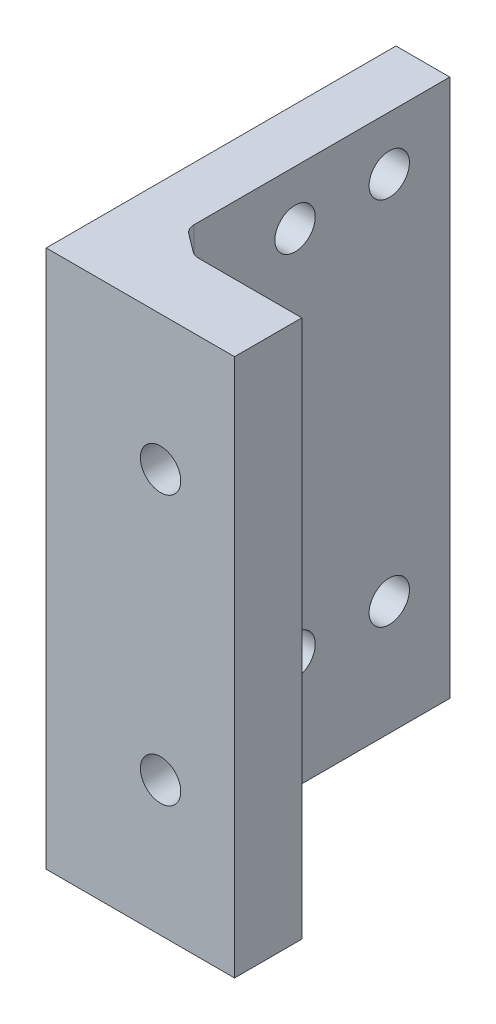
ISO-10303-21;
HEADER;
FILE_DESCRIPTION(('STEP AP214'),'2;1');
FILE_NAME('part.step','',(''),(''),'','','');
FILE_SCHEMA(('AUTOMOTIVE_DESIGN { 1 0 10303 214 1 1 1 1 }'));
ENDSEC;
DATA;
#1=APPLICATION_CONTEXT('core data for automotive mechanical design processes');
#2=APPLICATION_PROTOCOL_DEFINITION('international standard','automotive_design',2000,#1);
#3=PRODUCT_CONTEXT('',#1,'mechanical');
#4=PRODUCT('Part','Part','',(#3));
#5=PRODUCT_RELATED_PRODUCT_CATEGORY('part','',(#4));
#6=PRODUCT_DEFINITION_FORMATION('','',#4);
#7=PRODUCT_DEFINITION_CONTEXT('part definition',#1,'design');
#8=PRODUCT_DEFINITION('design','',#6,#7);
#9=PRODUCT_DEFINITION_SHAPE('','',#8);
#10=(LENGTH_UNIT() NAMED_UNIT(*) SI_UNIT(.MILLI.,.METRE.));
#11=(NAMED_UNIT(*) PLANE_ANGLE_UNIT() SI_UNIT($,.RADIAN.));
#12=(NAMED_UNIT(*) SI_UNIT($,.STERADIAN.) SOLID_ANGLE_UNIT());
#13=UNCERTAINTY_MEASURE_WITH_UNIT(LENGTH_MEASURE(1.E-05),#10,'distance_accuracy_value','');
#14=(GEOMETRIC_REPRESENTATION_CONTEXT(3) GLOBAL_UNCERTAINTY_ASSIGNED_CONTEXT((#13)) GLOBAL_UNIT_ASSIGNED_CONTEXT((#10,
#11,#12)) REPRESENTATION_CONTEXT('',''));
#15=CARTESIAN_POINT('',(0.,0.,0.));
#16=DIRECTION('',(0.,0.,1.));
#17=DIRECTION('',(1.,0.,0.));
#18=AXIS2_PLACEMENT_3D('',#15,#16,#17);
#19=CARTESIAN_POINT('',(15.,-20.,-4.));
#20=DIRECTION('',(1.,0.,0.));
#21=DIRECTION('',(0.,0.,-1.));
#22=AXIS2_PLACEMENT_3D('',#19,#20,#21);
#23=PLANE('',#22);
#24=DIRECTION('',(0.,0.,1.));
#25=VECTOR('',#24,1.);
#26=CARTESIAN_POINT('',(15.,20.,-4.));
#27=LINE('',#26,#25);
#28=CARTESIAN_POINT('',(15.,20.,-4.));
#29=VERTEX_POINT('',#28);
#30=CARTESIAN_POINT('',(15.,20.,15.));
#31=VERTEX_POINT('',#30);
#32=EDGE_CURVE('E220',#29,#31,#27,.T.);
#33=ORIENTED_EDGE('',*,*,#32,.T.);
#34=DIRECTION('',(0.,-1.,0.));
#35=VECTOR('',#34,1.);
#36=CARTESIAN_POINT('',(15.,-20.,15.));
#37=LINE('',#36,#35);
#38=CARTESIAN_POINT('',(15.,-20.,15.));
#39=VERTEX_POINT('',#38);
#40=EDGE_CURVE('E222',#31,#39,#37,.T.);
#41=ORIENTED_EDGE('',*,*,#40,.T.);
#42=DIRECTION('',(0.,0.,1.));
#43=VECTOR('',#42,1.);
#44=CARTESIAN_POINT('',(15.,-20.,-4.));
#45=LINE('',#44,#43);
#46=CARTESIAN_POINT('',(15.,-20.,-4.));
#47=VERTEX_POINT('',#46);
#48=EDGE_CURVE('E121',#47,#39,#45,.T.);
#49=ORIENTED_EDGE('',*,*,#48,.F.);
#50=DIRECTION('',(0.,1.,0.));
#51=VECTOR('',#50,1.);
#52=CARTESIAN_POINT('',(15.,-20.,-4.));
#53=LINE('',#52,#51);
#54=EDGE_CURVE('E204',#47,#29,#53,.T.);
#55=ORIENTED_EDGE('',*,*,#54,.T.);
#56=EDGE_LOOP('',(#33,#41,#49,#55));
#57=FACE_BOUND('',#56,.T.);
#58=CARTESIAN_POINT('',(15.,15.9999999999999,7.5));
#59=DIRECTION('',(1.,0.,0.));
#60=DIRECTION('',(0.,0.,-1.));
#61=AXIS2_PLACEMENT_3D('',#58,#59,#60);
#62=CIRCLE('',#61,1.5);
#63=CARTESIAN_POINT('',(15.,15.9999999999999,6.));
#64=VERTEX_POINT('',#63);
#65=EDGE_CURVE('E189',#64,#64,#62,.T.);
#66=ORIENTED_EDGE('',*,*,#65,.F.);
#67=EDGE_LOOP('',(#66));
#68=FACE_BOUND('',#67,.T.);
#69=CARTESIAN_POINT('',(15.,-11.5,0.500000000000174));
#70=DIRECTION('',(1.,0.,0.));
#71=DIRECTION('',(0.,0.,-1.));
#72=AXIS2_PLACEMENT_3D('',#69,#70,#71);
#73=CIRCLE('',#72,1.5);
#74=CARTESIAN_POINT('',(15.,-11.5,-0.999999999999826));
#75=VERTEX_POINT('',#74);
#76=EDGE_CURVE('E180',#75,#75,#73,.T.);
#77=ORIENTED_EDGE('',*,*,#76,.F.);
#78=EDGE_LOOP('',(#77));
#79=FACE_BOUND('',#78,.T.);
#80=CARTESIAN_POINT('',(15.,-11.5,7.5));
#81=DIRECTION('',(1.,0.,0.));
#82=DIRECTION('',(0.,0.,-1.));
#83=AXIS2_PLACEMENT_3D('',#80,#81,#82);
#84=CIRCLE('',#83,1.5);
#85=CARTESIAN_POINT('',(15.,-11.5,6.));
#86=VERTEX_POINT('',#85);
#87=EDGE_CURVE('E175',#86,#86,#84,.T.);
#88=ORIENTED_EDGE('',*,*,#87,.F.);
#89=EDGE_LOOP('',(#88));
#90=FACE_BOUND('',#89,.T.);
#91=CARTESIAN_POINT('',(15.,16.0000000000001,0.500000000000175));
#92=DIRECTION('',(1.,0.,0.));
#93=DIRECTION('',(0.,0.,-1.));
#94=AXIS2_PLACEMENT_3D('',#91,#92,#93);
#95=CIRCLE('',#94,1.5);
#96=CARTESIAN_POINT('',(15.,16.0000000000001,-0.999999999999826));
#97=VERTEX_POINT('',#96);
#98=EDGE_CURVE('E188',#97,#97,#95,.T.);
#99=ORIENTED_EDGE('',*,*,#98,.F.);
#100=EDGE_LOOP('',(#99));
#101=FACE_BOUND('',#100,.T.);
#102=ADVANCED_FACE('F39',(#57,#68,#79,#90,#101),#23,.T.);
#103=CARTESIAN_POINT('',(15.,-20.,-4.));
#104=DIRECTION('',(0.,-1.,0.));
#105=DIRECTION('',(1.,0.,0.));
#106=AXIS2_PLACEMENT_3D('',#103,#104,#105);
#107=PLANE('',#106);
#108=ORIENTED_EDGE('',*,*,#48,.T.);
#109=CARTESIAN_POINT('',(16.,-20.,15.));
#110=DIRECTION('',(0.,-1.,0.));
#111=DIRECTION('',(1.,0.,0.));
#112=AXIS2_PLACEMENT_3D('',#109,#110,#111);
#113=CIRCLE('',#112,1.);
#114=CARTESIAN_POINT('',(15.4,-20.,15.8));
#115=VERTEX_POINT('',#114);
#116=EDGE_CURVE('E241',#39,#115,#113,.F.);
#117=ORIENTED_EDGE('',*,*,#116,.T.);
#118=DIRECTION('',(0.799999999999999,0.,0.600000000000001));
#119=VECTOR('',#118,1.);
#120=CARTESIAN_POINT('',(15.,-20.,15.5));
#121=LINE('',#120,#119);
#122=CARTESIAN_POINT('',(16.7333333333334,-20.,16.8));
#123=VERTEX_POINT('',#122);
#124=EDGE_CURVE('E262',#115,#123,#121,.T.);
#125=ORIENTED_EDGE('',*,*,#124,.T.);
#126=CARTESIAN_POINT('',(17.3333333333334,-20.,16.));
#127=DIRECTION('',(0.,-1.,0.));
#128=DIRECTION('',(1.,0.,0.));
#129=AXIS2_PLACEMENT_3D('',#126,#127,#128);
#130=CIRCLE('',#129,1.);
#131=CARTESIAN_POINT('',(17.3333333333334,-20.,17.));
#132=VERTEX_POINT('',#131);
#133=EDGE_CURVE('E48',#123,#132,#130,.F.);
#134=ORIENTED_EDGE('',*,*,#133,.T.);
#135=DIRECTION('',(-1.,0.,0.));
#136=VECTOR('',#135,1.);
#137=CARTESIAN_POINT('',(25.,-20.,17.));
#138=LINE('',#137,#136);
#139=CARTESIAN_POINT('',(25.,-20.,17.));
#140=VERTEX_POINT('',#139);
#141=EDGE_CURVE('E172',#140,#132,#138,.T.);
#142=ORIENTED_EDGE('',*,*,#141,.F.);
#143=DIRECTION('',(0.,0.,-1.));
#144=VECTOR('',#143,1.);
#145=CARTESIAN_POINT('',(25.,-20.,20.));
#146=LINE('',#145,#144);
#147=CARTESIAN_POINT('',(25.,-20.,22.));
#148=VERTEX_POINT('',#147);
#149=EDGE_CURVE('E128',#148,#140,#146,.T.);
#150=ORIENTED_EDGE('',*,*,#149,.F.);
#151=DIRECTION('',(1.,0.,0.));
#152=VECTOR('',#151,1.);
#153=CARTESIAN_POINT('',(11.,-20.,22.));
#154=LINE('',#153,#152);
#155=CARTESIAN_POINT('',(11.,-20.,22.));
#156=VERTEX_POINT('',#155);
#157=EDGE_CURVE('E125',#156,#148,#154,.T.);
#158=ORIENTED_EDGE('',*,*,#157,.F.);
#159=DIRECTION('',(0.,0.,1.));
#160=VECTOR('',#159,1.);
#161=CARTESIAN_POINT('',(11.,-20.,-4.));
#162=LINE('',#161,#160);
#163=CARTESIAN_POINT('',(11.,-20.,-4.));
#164=VERTEX_POINT('',#163);
#165=EDGE_CURVE('E111',#164,#156,#162,.T.);
#166=ORIENTED_EDGE('',*,*,#165,.F.);
#167=DIRECTION('',(1.,0.,0.));
#168=VECTOR('',#167,1.);
#169=CARTESIAN_POINT('',(15.,-20.,-4.));
#170=LINE('',#169,#168);
#171=EDGE_CURVE('E217',#164,#47,#170,.T.);
#172=ORIENTED_EDGE('',*,*,#171,.T.);
#173=EDGE_LOOP('',(#108,#117,#125,#134,#142,#150,#158,#166,#172));
#174=FACE_BOUND('',#173,.T.);
#175=ADVANCED_FACE('F127',(#174),#107,.T.);
#176=CARTESIAN_POINT('',(11.,-20.,-4.));
#177=DIRECTION('',(-1.,0.,0.));
#178=DIRECTION('',(0.,-1.,0.));
#179=AXIS2_PLACEMENT_3D('',#176,#177,#178);
#180=PLANE('',#179);
#181=CARTESIAN_POINT('',(11.,15.9999999999999,7.5));
#182=DIRECTION('',(1.,0.,0.));
#183=DIRECTION('',(0.,0.,-1.));
#184=AXIS2_PLACEMENT_3D('',#181,#182,#183);
#185=CIRCLE('',#184,1.5);
#186=CARTESIAN_POINT('',(11.,15.9999999999999,6.));
#187=VERTEX_POINT('',#186);
#188=EDGE_CURVE('E184',#187,#187,#185,.T.);
#189=ORIENTED_EDGE('',*,*,#188,.T.);
#190=EDGE_LOOP('',(#189));
#191=FACE_BOUND('',#190,.T.);
#192=CARTESIAN_POINT('',(11.,-11.5,0.500000000000174));
#193=DIRECTION('',(1.,0.,0.));
#194=DIRECTION('',(0.,0.,-1.));
#195=AXIS2_PLACEMENT_3D('',#192,#193,#194);
#196=CIRCLE('',#195,1.5);
#197=CARTESIAN_POINT('',(11.,-11.5,-0.999999999999826));
#198=VERTEX_POINT('',#197);
#199=EDGE_CURVE('E193',#198,#198,#196,.T.);
#200=ORIENTED_EDGE('',*,*,#199,.T.);
#201=EDGE_LOOP('',(#200));
#202=FACE_BOUND('',#201,.T.);
#203=CARTESIAN_POINT('',(11.,-11.5,7.5));
#204=DIRECTION('',(1.,0.,0.));
#205=DIRECTION('',(0.,0.,-1.));
#206=AXIS2_PLACEMENT_3D('',#203,#204,#205);
#207=CIRCLE('',#206,1.5);
#208=CARTESIAN_POINT('',(11.,-11.5,6.));
#209=VERTEX_POINT('',#208);
#210=EDGE_CURVE('E176',#209,#209,#207,.T.);
#211=ORIENTED_EDGE('',*,*,#210,.T.);
#212=EDGE_LOOP('',(#211));
#213=FACE_BOUND('',#212,.T.);
#214=CARTESIAN_POINT('',(11.,16.0000000000001,0.500000000000175));
#215=DIRECTION('',(1.,0.,0.));
#216=DIRECTION('',(0.,0.,-1.));
#217=AXIS2_PLACEMENT_3D('',#214,#215,#216);
#218=CIRCLE('',#217,1.5);
#219=CARTESIAN_POINT('',(11.,16.0000000000001,-0.999999999999826));
#220=VERTEX_POINT('',#219);
#221=EDGE_CURVE('E200',#220,#220,#218,.T.);
#222=ORIENTED_EDGE('',*,*,#221,.T.);
#223=EDGE_LOOP('',(#222));
#224=FACE_BOUND('',#223,.T.);
#225=ORIENTED_EDGE('',*,*,#165,.T.);
#226=DIRECTION('',(0.,-1.,0.));
#227=VECTOR('',#226,1.);
#228=CARTESIAN_POINT('',(11.,20.,22.));
#229=LINE('',#228,#227);
#230=CARTESIAN_POINT('',(11.,20.,22.));
#231=VERTEX_POINT('',#230);
#232=EDGE_CURVE('E115',#231,#156,#229,.T.);
#233=ORIENTED_EDGE('',*,*,#232,.F.);
#234=DIRECTION('',(0.,0.,1.));
#235=VECTOR('',#234,1.);
#236=CARTESIAN_POINT('',(11.,20.,-4.));
#237=LINE('',#236,#235);
#238=CARTESIAN_POINT('',(11.,20.,-4.));
#239=VERTEX_POINT('',#238);
#240=EDGE_CURVE('E122',#239,#231,#237,.T.);
#241=ORIENTED_EDGE('',*,*,#240,.F.);
#242=DIRECTION('',(0.,-1.,0.));
#243=VECTOR('',#242,1.);
#244=CARTESIAN_POINT('',(11.,-20.,-4.));
#245=LINE('',#244,#243);
#246=EDGE_CURVE('E117',#239,#164,#245,.T.);
#247=ORIENTED_EDGE('',*,*,#246,.T.);
#248=EDGE_LOOP('',(#225,#233,#241,#247));
#249=FACE_BOUND('',#248,.T.);
#250=ADVANCED_FACE('F113',(#191,#202,#213,#224,#249),#180,.T.);
#251=CARTESIAN_POINT('',(15.,20.,-4.));
#252=DIRECTION('',(0.,1.,0.));
#253=DIRECTION('',(0.,0.,1.));
#254=AXIS2_PLACEMENT_3D('',#251,#252,#253);
#255=PLANE('',#254);
#256=DIRECTION('',(0.799999999999999,0.,0.600000000000001));
#257=VECTOR('',#256,1.);
#258=CARTESIAN_POINT('',(15.,20.,15.5));
#259=LINE('',#258,#257);
#260=CARTESIAN_POINT('',(15.4,20.,15.8));
#261=VERTEX_POINT('',#260);
#262=CARTESIAN_POINT('',(16.7333333333333,20.,16.8));
#263=VERTEX_POINT('',#262);
#264=EDGE_CURVE('E253',#261,#263,#259,.T.);
#265=ORIENTED_EDGE('',*,*,#264,.F.);
#266=CARTESIAN_POINT('',(16.,20.,15.));
#267=DIRECTION('',(0.,1.,0.));
#268=DIRECTION('',(0.,0.,1.));
#269=AXIS2_PLACEMENT_3D('',#266,#267,#268);
#270=CIRCLE('',#269,1.);
#271=EDGE_CURVE('E244',#261,#31,#270,.F.);
#272=ORIENTED_EDGE('',*,*,#271,.T.);
#273=ORIENTED_EDGE('',*,*,#32,.F.);
#274=DIRECTION('',(-1.,0.,0.));
#275=VECTOR('',#274,1.);
#276=CARTESIAN_POINT('',(15.,20.,-4.));
#277=LINE('',#276,#275);
#278=EDGE_CURVE('E211',#29,#239,#277,.T.);
#279=ORIENTED_EDGE('',*,*,#278,.T.);
#280=ORIENTED_EDGE('',*,*,#240,.T.);
#281=DIRECTION('',(-1.,0.,0.));
#282=VECTOR('',#281,1.);
#283=CARTESIAN_POINT('',(11.,20.,22.));
#284=LINE('',#283,#282);
#285=CARTESIAN_POINT('',(25.,20.,22.));
#286=VERTEX_POINT('',#285);
#287=EDGE_CURVE('E139',#286,#231,#284,.T.);
#288=ORIENTED_EDGE('',*,*,#287,.F.);
#289=DIRECTION('',(0.,0.,1.));
#290=VECTOR('',#289,1.);
#291=CARTESIAN_POINT('',(25.,20.,20.));
#292=LINE('',#291,#290);
#293=CARTESIAN_POINT('',(25.,20.,17.));
#294=VERTEX_POINT('',#293);
#295=EDGE_CURVE('E166',#294,#286,#292,.T.);
#296=ORIENTED_EDGE('',*,*,#295,.F.);
#297=DIRECTION('',(-1.,0.,0.));
#298=VECTOR('',#297,1.);
#299=CARTESIAN_POINT('',(25.,20.,17.));
#300=LINE('',#299,#298);
#301=CARTESIAN_POINT('',(17.3333333333333,20.,17.));
#302=VERTEX_POINT('',#301);
#303=EDGE_CURVE('E169',#294,#302,#300,.T.);
#304=ORIENTED_EDGE('',*,*,#303,.T.);
#305=CARTESIAN_POINT('',(17.3333333333333,20.,16.));
#306=DIRECTION('',(0.,1.,0.));
#307=DIRECTION('',(0.,0.,1.));
#308=AXIS2_PLACEMENT_3D('',#305,#306,#307);
#309=CIRCLE('',#308,1.);
#310=EDGE_CURVE('E11',#302,#263,#309,.F.);
#311=ORIENTED_EDGE('',*,*,#310,.T.);
#312=EDGE_LOOP('',(#265,#272,#273,#279,#280,#288,#296,#304,#311));
#313=FACE_BOUND('',#312,.T.);
#314=ADVANCED_FACE('F250',(#313),#255,.T.);
#315=CARTESIAN_POINT('',(0.,0.,-4.));
#316=DIRECTION('',(0.,0.,1.));
#317=DIRECTION('',(1.,0.,0.));
#318=AXIS2_PLACEMENT_3D('',#315,#316,#317);
#319=PLANE('',#318);
#320=ORIENTED_EDGE('',*,*,#54,.F.);
#321=ORIENTED_EDGE('',*,*,#171,.F.);
#322=ORIENTED_EDGE('',*,*,#246,.F.);
#323=ORIENTED_EDGE('',*,*,#278,.F.);
#324=EDGE_LOOP('',(#320,#321,#322,#323));
#325=FACE_BOUND('',#324,.T.);
#326=ADVANCED_FACE('F309',(#325),#319,.F.);
#327=CARTESIAN_POINT('',(11.,16.0000000000001,0.500000000000175));
#328=DIRECTION('',(1.,0.,0.));
#329=DIRECTION('',(0.,0.,-1.));
#330=AXIS2_PLACEMENT_3D('',#327,#328,#329);
#331=CYLINDRICAL_SURFACE('',#330,1.5);
#332=ORIENTED_EDGE('',*,*,#221,.F.);
#333=EDGE_LOOP('',(#332));
#334=FACE_BOUND('',#333,.T.);
#335=ORIENTED_EDGE('',*,*,#98,.T.);
#336=EDGE_LOOP('',(#335));
#337=FACE_BOUND('',#336,.T.);
#338=ADVANCED_FACE('F311',(#334,#337),#331,.F.);
#339=CARTESIAN_POINT('',(11.,-11.5,7.5));
#340=DIRECTION('',(1.,0.,0.));
#341=DIRECTION('',(0.,0.,-1.));
#342=AXIS2_PLACEMENT_3D('',#339,#340,#341);
#343=CYLINDRICAL_SURFACE('',#342,1.5);
#344=ORIENTED_EDGE('',*,*,#210,.F.);
#345=EDGE_LOOP('',(#344));
#346=FACE_BOUND('',#345,.T.);
#347=ORIENTED_EDGE('',*,*,#87,.T.);
#348=EDGE_LOOP('',(#347));
#349=FACE_BOUND('',#348,.T.);
#350=ADVANCED_FACE('F317',(#346,#349),#343,.F.);
#351=CARTESIAN_POINT('',(11.,-11.5,0.500000000000174));
#352=DIRECTION('',(1.,0.,0.));
#353=DIRECTION('',(0.,0.,-1.));
#354=AXIS2_PLACEMENT_3D('',#351,#352,#353);
#355=CYLINDRICAL_SURFACE('',#354,1.5);
#356=ORIENTED_EDGE('',*,*,#199,.F.);
#357=EDGE_LOOP('',(#356));
#358=FACE_BOUND('',#357,.T.);
#359=ORIENTED_EDGE('',*,*,#76,.T.);
#360=EDGE_LOOP('',(#359));
#361=FACE_BOUND('',#360,.T.);
#362=ADVANCED_FACE('F338',(#358,#361),#355,.F.);
#363=CARTESIAN_POINT('',(11.,15.9999999999999,7.5));
#364=DIRECTION('',(1.,0.,0.));
#365=DIRECTION('',(0.,0.,-1.));
#366=AXIS2_PLACEMENT_3D('',#363,#364,#365);
#367=CYLINDRICAL_SURFACE('',#366,1.5);
#368=ORIENTED_EDGE('',*,*,#188,.F.);
#369=EDGE_LOOP('',(#368));
#370=FACE_BOUND('',#369,.T.);
#371=ORIENTED_EDGE('',*,*,#65,.T.);
#372=EDGE_LOOP('',(#371));
#373=FACE_BOUND('',#372,.T.);
#374=ADVANCED_FACE('F345',(#370,#373),#367,.F.);
#375=CARTESIAN_POINT('',(25.,20.,17.));
#376=DIRECTION('',(0.,0.,1.));
#377=DIRECTION('',(0.,-1.,0.));
#378=AXIS2_PLACEMENT_3D('',#375,#376,#377);
#379=PLANE('',#378);
#380=CARTESIAN_POINT('',(19.5,-9.99999999999999,17.));
#381=DIRECTION('',(0.,0.,-1.));
#382=DIRECTION('',(0.,1.,0.));
#383=AXIS2_PLACEMENT_3D('',#380,#381,#382);
#384=CIRCLE('',#383,1.5);
#385=CARTESIAN_POINT('',(19.5,-8.49999999999999,17.));
#386=VERTEX_POINT('',#385);
#387=EDGE_CURVE('E154',#386,#386,#384,.T.);
#388=ORIENTED_EDGE('',*,*,#387,.F.);
#389=EDGE_LOOP('',(#388));
#390=FACE_BOUND('',#389,.T.);
#391=CARTESIAN_POINT('',(19.5,10.,17.));
#392=DIRECTION('',(0.,0.,-1.));
#393=DIRECTION('',(0.,1.,0.));
#394=AXIS2_PLACEMENT_3D('',#391,#392,#393);
#395=CIRCLE('',#394,1.5);
#396=CARTESIAN_POINT('',(19.5,11.5,17.));
#397=VERTEX_POINT('',#396);
#398=EDGE_CURVE('E153',#397,#397,#395,.T.);
#399=ORIENTED_EDGE('',*,*,#398,.F.);
#400=EDGE_LOOP('',(#399));
#401=FACE_BOUND('',#400,.T.);
#402=ORIENTED_EDGE('',*,*,#141,.T.);
#403=DIRECTION('',(0.,-1.,0.));
#404=VECTOR('',#403,1.);
#405=CARTESIAN_POINT('',(17.3333333333333,20.,17.));
#406=LINE('',#405,#404);
#407=EDGE_CURVE('E55',#132,#302,#406,.F.);
#408=ORIENTED_EDGE('',*,*,#407,.T.);
#409=ORIENTED_EDGE('',*,*,#303,.F.);
#410=DIRECTION('',(0.,1.,0.));
#411=VECTOR('',#410,1.);
#412=CARTESIAN_POINT('',(25.,20.,17.));
#413=LINE('',#412,#411);
#414=EDGE_CURVE('E163',#140,#294,#413,.T.);
#415=ORIENTED_EDGE('',*,*,#414,.F.);
#416=EDGE_LOOP('',(#402,#408,#409,#415));
#417=FACE_BOUND('',#416,.T.);
#418=ADVANCED_FACE('F305',(#390,#401,#417),#379,.F.);
#419=CARTESIAN_POINT('',(25.,0.,0.));
#420=DIRECTION('',(1.,0.,0.));
#421=DIRECTION('',(0.,0.,-1.));
#422=AXIS2_PLACEMENT_3D('',#419,#420,#421);
#423=PLANE('',#422);
#424=ORIENTED_EDGE('',*,*,#295,.T.);
#425=DIRECTION('',(0.,1.,0.));
#426=VECTOR('',#425,1.);
#427=CARTESIAN_POINT('',(25.,20.,22.));
#428=LINE('',#427,#426);
#429=EDGE_CURVE('E133',#148,#286,#428,.T.);
#430=ORIENTED_EDGE('',*,*,#429,.F.);
#431=ORIENTED_EDGE('',*,*,#149,.T.);
#432=ORIENTED_EDGE('',*,*,#414,.T.);
#433=EDGE_LOOP('',(#424,#430,#431,#432));
#434=FACE_BOUND('',#433,.T.);
#435=ADVANCED_FACE('F307',(#434),#423,.T.);
#436=CARTESIAN_POINT('',(19.5,10.,20.));
#437=DIRECTION('',(0.,0.,-1.));
#438=DIRECTION('',(0.,1.,0.));
#439=AXIS2_PLACEMENT_3D('',#436,#437,#438);
#440=CYLINDRICAL_SURFACE('',#439,1.5);
#441=CARTESIAN_POINT('',(19.5,10.,22.));
#442=DIRECTION('',(0.,0.,1.));
#443=DIRECTION('',(1.,0.,0.));
#444=AXIS2_PLACEMENT_3D('',#441,#442,#443);
#445=CIRCLE('',#444,1.5);
#446=CARTESIAN_POINT('',(19.5,11.5,22.));
#447=VERTEX_POINT('',#446);
#448=EDGE_CURVE('E141',#447,#447,#445,.T.);
#449=CARTESIAN_POINT('',(19.5,11.5,17.));
#450=CARTESIAN_POINT('',(19.5,11.5,17.0520833333333));
#451=CARTESIAN_POINT('',(19.5,11.5,17.1041666666667));
#452=CARTESIAN_POINT('',(19.5,11.5,17.2083333333333));
#453=CARTESIAN_POINT('',(19.5,11.5,17.2604166666667));
#454=CARTESIAN_POINT('',(19.5,11.5,17.3645833333333));
#455=CARTESIAN_POINT('',(19.5,11.5,17.4166666666667));
#456=CARTESIAN_POINT('',(19.5,11.5,17.5208333333333));
#457=CARTESIAN_POINT('',(19.5,11.5,17.5729166666667));
#458=CARTESIAN_POINT('',(19.5,11.5,17.6770833333333));
#459=CARTESIAN_POINT('',(19.5,11.5,17.7291666666667));
#460=CARTESIAN_POINT('',(19.5,11.5,17.8333333333333));
#461=CARTESIAN_POINT('',(19.5,11.5,17.8854166666667));
#462=CARTESIAN_POINT('',(19.5,11.5,17.9895833333333));
#463=CARTESIAN_POINT('',(19.5,11.5,18.0416666666667));
#464=CARTESIAN_POINT('',(19.5,11.5,18.1458333333333));
#465=CARTESIAN_POINT('',(19.5,11.5,18.1979166666667));
#466=CARTESIAN_POINT('',(19.5,11.5,18.3020833333333));
#467=CARTESIAN_POINT('',(19.5,11.5,18.3541666666667));
#468=CARTESIAN_POINT('',(19.5,11.5,18.4583333333333));
#469=CARTESIAN_POINT('',(19.5,11.5,18.5104166666667));
#470=CARTESIAN_POINT('',(19.5,11.5,18.6145833333333));
#471=CARTESIAN_POINT('',(19.5,11.5,18.6666666666667));
#472=CARTESIAN_POINT('',(19.5,11.5,18.7708333333333));
#473=CARTESIAN_POINT('',(19.5,11.5,18.8229166666667));
#474=CARTESIAN_POINT('',(19.5,11.5,18.9270833333333));
#475=CARTESIAN_POINT('',(19.5,11.5,18.9791666666667));
#476=CARTESIAN_POINT('',(19.5,11.5,19.0833333333333));
#477=CARTESIAN_POINT('',(19.5,11.5,19.1354166666667));
#478=CARTESIAN_POINT('',(19.5,11.5,19.2395833333333));
#479=CARTESIAN_POINT('',(19.5,11.5,19.2916666666667));
#480=CARTESIAN_POINT('',(19.5,11.5,19.3958333333333));
#481=CARTESIAN_POINT('',(19.5,11.5,19.4479166666667));
#482=CARTESIAN_POINT('',(19.5,11.5,19.5520833333333));
#483=CARTESIAN_POINT('',(19.5,11.5,19.6041666666667));
#484=CARTESIAN_POINT('',(19.5,11.5,19.7083333333333));
#485=CARTESIAN_POINT('',(19.5,11.5,19.7604166666667));
#486=CARTESIAN_POINT('',(19.5,11.5,19.8645833333333));
#487=CARTESIAN_POINT('',(19.5,11.5,19.9166666666667));
#488=CARTESIAN_POINT('',(19.5,11.5,20.0208333333333));
#489=CARTESIAN_POINT('',(19.5,11.5,20.0729166666667));
#490=CARTESIAN_POINT('',(19.5,11.5,20.1770833333333));
#491=CARTESIAN_POINT('',(19.5,11.5,20.2291666666667));
#492=CARTESIAN_POINT('',(19.5,11.5,20.3333333333333));
#493=CARTESIAN_POINT('',(19.5,11.5,20.3854166666667));
#494=CARTESIAN_POINT('',(19.5,11.5,20.4895833333333));
#495=CARTESIAN_POINT('',(19.5,11.5,20.5416666666667));
#496=CARTESIAN_POINT('',(19.5,11.5,20.6458333333333));
#497=CARTESIAN_POINT('',(19.5,11.5,20.6979166666667));
#498=CARTESIAN_POINT('',(19.5,11.5,20.8020833333333));
#499=CARTESIAN_POINT('',(19.5,11.5,20.8541666666667));
#500=CARTESIAN_POINT('',(19.5,11.5,20.9583333333333));
#501=CARTESIAN_POINT('',(19.5,11.5,21.0104166666667));
#502=CARTESIAN_POINT('',(19.5,11.5,21.1145833333333));
#503=CARTESIAN_POINT('',(19.5,11.5,21.1666666666667));
#504=CARTESIAN_POINT('',(19.5,11.5,21.2708333333333));
#505=CARTESIAN_POINT('',(19.5,11.5,21.3229166666667));
#506=CARTESIAN_POINT('',(19.5,11.5,21.4270833333333));
#507=CARTESIAN_POINT('',(19.5,11.5,21.4791666666667));
#508=CARTESIAN_POINT('',(19.5,11.5,21.5833333333333));
#509=CARTESIAN_POINT('',(19.5,11.5,21.6354166666667));
#510=CARTESIAN_POINT('',(19.5,11.5,21.7395833333333));
#511=CARTESIAN_POINT('',(19.5,11.5,21.7916666666667));
#512=CARTESIAN_POINT('',(19.5,11.5,21.8958333333333));
#513=CARTESIAN_POINT('',(19.5,11.5,21.9479166666667));
#514=CARTESIAN_POINT('',(19.5,11.5,22.));
#515=B_SPLINE_CURVE_WITH_KNOTS('',3,(#449,#450,#451,#452,#453,#454,#455,#456,#457,#458,#459,
#460,#461,#462,#463,#464,#465,#466,#467,#468,#469,#470,#471,#472,#473,#474,#475,#476,#477,#478,
#479,#480,#481,#482,#483,#484,#485,#486,#487,#488,#489,#490,#491,#492,#493,#494,#495,#496,#497,
#498,#499,#500,#501,#502,#503,#504,#505,#506,#507,#508,#509,#510,#511,#512,#513,#514),
.UNSPECIFIED.,.F.,.F.,(4,2,2,2,2,2,2,2,2,2,2,2,2,2,2,2,2,2,2,2,2,2,2,2,2,2,2,2,2,2,2,2,4),(0.,
0.15625,0.3125,0.46875,0.625000000000001,0.781250000000001,0.937500000000001,1.09375,1.25,
1.40625,1.5625,1.71875,1.875,2.03125,2.1875,2.34375,2.5,2.65625,2.8125,2.96875,3.125,3.28125,
3.4375,3.59375,3.75,3.90625,4.0625,4.21875,4.375,4.53125,4.6875,4.84375,5.),.UNSPECIFIED.);
#516=EDGE_CURVE('BSEAM283',#397,#447,#515,.T.);
#517=ORIENTED_EDGE('',*,*,#398,.T.);
#518=ORIENTED_EDGE('',*,*,#448,.T.);
#519=ORIENTED_EDGE('',*,*,#516,.T.);
#520=ORIENTED_EDGE('',*,*,#516,.F.);
#521=EDGE_LOOP('',(#517,#519,#518,#520));
#522=FACE_BOUND('',#521,.T.);
#523=ADVANCED_FACE('F283',(#522),#440,.F.);
#524=CARTESIAN_POINT('',(19.5,-9.99999999999999,20.));
#525=DIRECTION('',(0.,0.,-1.));
#526=DIRECTION('',(0.,1.,0.));
#527=AXIS2_PLACEMENT_3D('',#524,#525,#526);
#528=CYLINDRICAL_SURFACE('',#527,1.5);
#529=CARTESIAN_POINT('',(19.5,-9.99999999999999,22.));
#530=DIRECTION('',(0.,0.,1.));
#531=DIRECTION('',(1.,0.,0.));
#532=AXIS2_PLACEMENT_3D('',#529,#530,#531);
#533=CIRCLE('',#532,1.5);
#534=CARTESIAN_POINT('',(19.5,-8.49999999999999,22.));
#535=VERTEX_POINT('',#534);
#536=EDGE_CURVE('E145',#535,#535,#533,.T.);
#537=CARTESIAN_POINT('',(19.5,-8.49999999999999,17.));
#538=CARTESIAN_POINT('',(19.5,-8.49999999999999,17.0520833333333));
#539=CARTESIAN_POINT('',(19.5,-8.49999999999999,17.1041666666667));
#540=CARTESIAN_POINT('',(19.5,-8.49999999999999,17.2083333333333));
#541=CARTESIAN_POINT('',(19.5,-8.49999999999999,17.2604166666667));
#542=CARTESIAN_POINT('',(19.5,-8.49999999999999,17.3645833333333));
#543=CARTESIAN_POINT('',(19.5,-8.49999999999999,17.4166666666667));
#544=CARTESIAN_POINT('',(19.5,-8.49999999999999,17.5208333333333));
#545=CARTESIAN_POINT('',(19.5,-8.49999999999999,17.5729166666667));
#546=CARTESIAN_POINT('',(19.5,-8.49999999999999,17.6770833333333));
#547=CARTESIAN_POINT('',(19.5,-8.49999999999999,17.7291666666667));
#548=CARTESIAN_POINT('',(19.5,-8.49999999999999,17.8333333333333));
#549=CARTESIAN_POINT('',(19.5,-8.49999999999999,17.8854166666667));
#550=CARTESIAN_POINT('',(19.5,-8.49999999999999,17.9895833333333));
#551=CARTESIAN_POINT('',(19.5,-8.49999999999999,18.0416666666667));
#552=CARTESIAN_POINT('',(19.5,-8.49999999999999,18.1458333333333));
#553=CARTESIAN_POINT('',(19.5,-8.49999999999999,18.1979166666667));
#554=CARTESIAN_POINT('',(19.5,-8.49999999999999,18.3020833333333));
#555=CARTESIAN_POINT('',(19.5,-8.49999999999999,18.3541666666667));
#556=CARTESIAN_POINT('',(19.5,-8.49999999999999,18.4583333333333));
#557=CARTESIAN_POINT('',(19.5,-8.49999999999999,18.5104166666667));
#558=CARTESIAN_POINT('',(19.5,-8.49999999999999,18.6145833333333));
#559=CARTESIAN_POINT('',(19.5,-8.49999999999999,18.6666666666667));
#560=CARTESIAN_POINT('',(19.5,-8.49999999999999,18.7708333333333));
#561=CARTESIAN_POINT('',(19.5,-8.49999999999999,18.8229166666667));
#562=CARTESIAN_POINT('',(19.5,-8.49999999999999,18.9270833333333));
#563=CARTESIAN_POINT('',(19.5,-8.49999999999999,18.9791666666667));
#564=CARTESIAN_POINT('',(19.5,-8.49999999999999,19.0833333333333));
#565=CARTESIAN_POINT('',(19.5,-8.49999999999999,19.1354166666667));
#566=CARTESIAN_POINT('',(19.5,-8.49999999999999,19.2395833333333));
#567=CARTESIAN_POINT('',(19.5,-8.49999999999999,19.2916666666667));
#568=CARTESIAN_POINT('',(19.5,-8.49999999999999,19.3958333333333));
#569=CARTESIAN_POINT('',(19.5,-8.49999999999999,19.4479166666667));
#570=CARTESIAN_POINT('',(19.5,-8.49999999999999,19.5520833333333));
#571=CARTESIAN_POINT('',(19.5,-8.49999999999999,19.6041666666667));
#572=CARTESIAN_POINT('',(19.5,-8.49999999999999,19.7083333333333));
#573=CARTESIAN_POINT('',(19.5,-8.49999999999999,19.7604166666667));
#574=CARTESIAN_POINT('',(19.5,-8.49999999999999,19.8645833333333));
#575=CARTESIAN_POINT('',(19.5,-8.49999999999999,19.9166666666667));
#576=CARTESIAN_POINT('',(19.5,-8.49999999999999,20.0208333333333));
#577=CARTESIAN_POINT('',(19.5,-8.49999999999999,20.0729166666667));
#578=CARTESIAN_POINT('',(19.5,-8.49999999999999,20.1770833333333));
#579=CARTESIAN_POINT('',(19.5,-8.49999999999999,20.2291666666667));
#580=CARTESIAN_POINT('',(19.5,-8.49999999999999,20.3333333333333));
#581=CARTESIAN_POINT('',(19.5,-8.49999999999999,20.3854166666667));
#582=CARTESIAN_POINT('',(19.5,-8.49999999999999,20.4895833333333));
#583=CARTESIAN_POINT('',(19.5,-8.49999999999999,20.5416666666667));
#584=CARTESIAN_POINT('',(19.5,-8.49999999999999,20.6458333333333));
#585=CARTESIAN_POINT('',(19.5,-8.49999999999999,20.6979166666667));
#586=CARTESIAN_POINT('',(19.5,-8.49999999999999,20.8020833333333));
#587=CARTESIAN_POINT('',(19.5,-8.49999999999999,20.8541666666667));
#588=CARTESIAN_POINT('',(19.5,-8.49999999999999,20.9583333333333));
#589=CARTESIAN_POINT('',(19.5,-8.49999999999999,21.0104166666667));
#590=CARTESIAN_POINT('',(19.5,-8.49999999999999,21.1145833333333));
#591=CARTESIAN_POINT('',(19.5,-8.49999999999999,21.1666666666667));
#592=CARTESIAN_POINT('',(19.5,-8.49999999999999,21.2708333333333));
#593=CARTESIAN_POINT('',(19.5,-8.49999999999999,21.3229166666667));
#594=CARTESIAN_POINT('',(19.5,-8.49999999999999,21.4270833333333));
#595=CARTESIAN_POINT('',(19.5,-8.49999999999999,21.4791666666667));
#596=CARTESIAN_POINT('',(19.5,-8.49999999999999,21.5833333333333));
#597=CARTESIAN_POINT('',(19.5,-8.49999999999999,21.6354166666667));
#598=CARTESIAN_POINT('',(19.5,-8.49999999999999,21.7395833333333));
#599=CARTESIAN_POINT('',(19.5,-8.49999999999999,21.7916666666667));
#600=CARTESIAN_POINT('',(19.5,-8.49999999999999,21.8958333333333));
#601=CARTESIAN_POINT('',(19.5,-8.49999999999999,21.9479166666667));
#602=CARTESIAN_POINT('',(19.5,-8.49999999999999,22.));
#603=B_SPLINE_CURVE_WITH_KNOTS('',3,(#537,#538,#539,#540,#541,#542,#543,#544,#545,#546,#547,
#548,#549,#550,#551,#552,#553,#554,#555,#556,#557,#558,#559,#560,#561,#562,#563,#564,#565,#566,
#567,#568,#569,#570,#571,#572,#573,#574,#575,#576,#577,#578,#579,#580,#581,#582,#583,#584,#585,
#586,#587,#588,#589,#590,#591,#592,#593,#594,#595,#596,#597,#598,#599,#600,#601,#602),
.UNSPECIFIED.,.F.,.F.,(4,2,2,2,2,2,2,2,2,2,2,2,2,2,2,2,2,2,2,2,2,2,2,2,2,2,2,2,2,2,2,2,4),(0.,
0.15625,0.3125,0.46875,0.625000000000001,0.781250000000001,0.937500000000001,1.09375,1.25,
1.40625,1.5625,1.71875,1.875,2.03125,2.1875,2.34375,2.5,2.65625,2.8125,2.96875,3.125,3.28125,
3.4375,3.59375,3.75,3.90625,4.0625,4.21875,4.375,4.53125,4.6875,4.84375,5.),.UNSPECIFIED.);
#604=EDGE_CURVE('BSEAM274',#386,#535,#603,.T.);
#605=ORIENTED_EDGE('',*,*,#387,.T.);
#606=ORIENTED_EDGE('',*,*,#536,.T.);
#607=ORIENTED_EDGE('',*,*,#604,.T.);
#608=ORIENTED_EDGE('',*,*,#604,.F.);
#609=EDGE_LOOP('',(#605,#607,#606,#608));
#610=FACE_BOUND('',#609,.T.);
#611=ADVANCED_FACE('F274',(#610),#528,.F.);
#612=CARTESIAN_POINT('',(0.,0.,22.));
#613=DIRECTION('',(0.,0.,1.));
#614=DIRECTION('',(1.,0.,0.));
#615=AXIS2_PLACEMENT_3D('',#612,#613,#614);
#616=PLANE('',#615);
#617=ORIENTED_EDGE('',*,*,#448,.F.);
#618=EDGE_LOOP('',(#617));
#619=FACE_BOUND('',#618,.T.);
#620=ORIENTED_EDGE('',*,*,#232,.T.);
#621=ORIENTED_EDGE('',*,*,#157,.T.);
#622=ORIENTED_EDGE('',*,*,#429,.T.);
#623=ORIENTED_EDGE('',*,*,#287,.T.);
#624=EDGE_LOOP('',(#620,#621,#622,#623));
#625=FACE_BOUND('',#624,.T.);
#626=ORIENTED_EDGE('',*,*,#536,.F.);
#627=EDGE_LOOP('',(#626));
#628=FACE_BOUND('',#627,.T.);
#629=ADVANCED_FACE('F136',(#619,#625,#628),#616,.T.);
#630=CARTESIAN_POINT('',(15.,22.5,15.5));
#631=DIRECTION('',(0.600000000000001,0.,-0.799999999999999));
#632=DIRECTION('',(-0.799999999999999,0.,-0.600000000000001));
#633=AXIS2_PLACEMENT_3D('',#630,#631,#632);
#634=PLANE('',#633);
#635=ORIENTED_EDGE('',*,*,#124,.F.);
#636=DIRECTION('',(0.,-1.,0.));
#637=VECTOR('',#636,1.);
#638=CARTESIAN_POINT('',(15.4,20.,15.8));
#639=LINE('',#638,#637);
#640=EDGE_CURVE('E236',#115,#261,#639,.F.);
#641=ORIENTED_EDGE('',*,*,#640,.T.);
#642=ORIENTED_EDGE('',*,*,#264,.T.);
#643=DIRECTION('',(0.,-1.,0.));
#644=VECTOR('',#643,1.);
#645=CARTESIAN_POINT('',(16.7333333333333,22.5,16.8));
#646=LINE('',#645,#644);
#647=EDGE_CURVE('E232',#263,#123,#646,.T.);
#648=ORIENTED_EDGE('',*,*,#647,.T.);
#649=EDGE_LOOP('',(#635,#641,#642,#648));
#650=FACE_BOUND('',#649,.T.);
#651=ADVANCED_FACE('F264',(#650),#634,.T.);
#652=CARTESIAN_POINT('',(16.,-20.,15.));
#653=DIRECTION('',(0.,1.,0.));
#654=DIRECTION('',(0.,0.,1.));
#655=AXIS2_PLACEMENT_3D('',#652,#653,#654);
#656=CYLINDRICAL_SURFACE('',#655,1.);
#657=ORIENTED_EDGE('',*,*,#271,.F.);
#658=ORIENTED_EDGE('',*,*,#640,.F.);
#659=ORIENTED_EDGE('',*,*,#116,.F.);
#660=ORIENTED_EDGE('',*,*,#40,.F.);
#661=EDGE_LOOP('',(#657,#658,#659,#660));
#662=FACE_BOUND('',#661,.T.);
#663=ADVANCED_FACE('F260',(#662),#656,.F.);
#664=CARTESIAN_POINT('',(17.3333333333333,22.5,16.));
#665=DIRECTION('',(0.,-1.,0.));
#666=DIRECTION('',(1.,0.,0.));
#667=AXIS2_PLACEMENT_3D('',#664,#665,#666);
#668=CYLINDRICAL_SURFACE('',#667,1.);
#669=ORIENTED_EDGE('',*,*,#310,.F.);
#670=ORIENTED_EDGE('',*,*,#407,.F.);
#671=ORIENTED_EDGE('',*,*,#133,.F.);
#672=ORIENTED_EDGE('',*,*,#647,.F.);
#673=EDGE_LOOP('',(#669,#670,#671,#672));
#674=FACE_BOUND('',#673,.T.);
#675=ADVANCED_FACE('F41',(#674),#668,.F.);
#676=CLOSED_SHELL('',(#102,#175,#250,#314,#326,#338,#350,#362,#374,#418,#435,#523,#611,#629,
#651,#663,#675));
#677=MANIFOLD_SOLID_BREP('B2',#676);
#678=ADVANCED_BREP_SHAPE_REPRESENTATION('',(#18,#677),#14);
#679=SHAPE_DEFINITION_REPRESENTATION(#9,#678);
ENDSEC;
END-ISO-10303-21;
